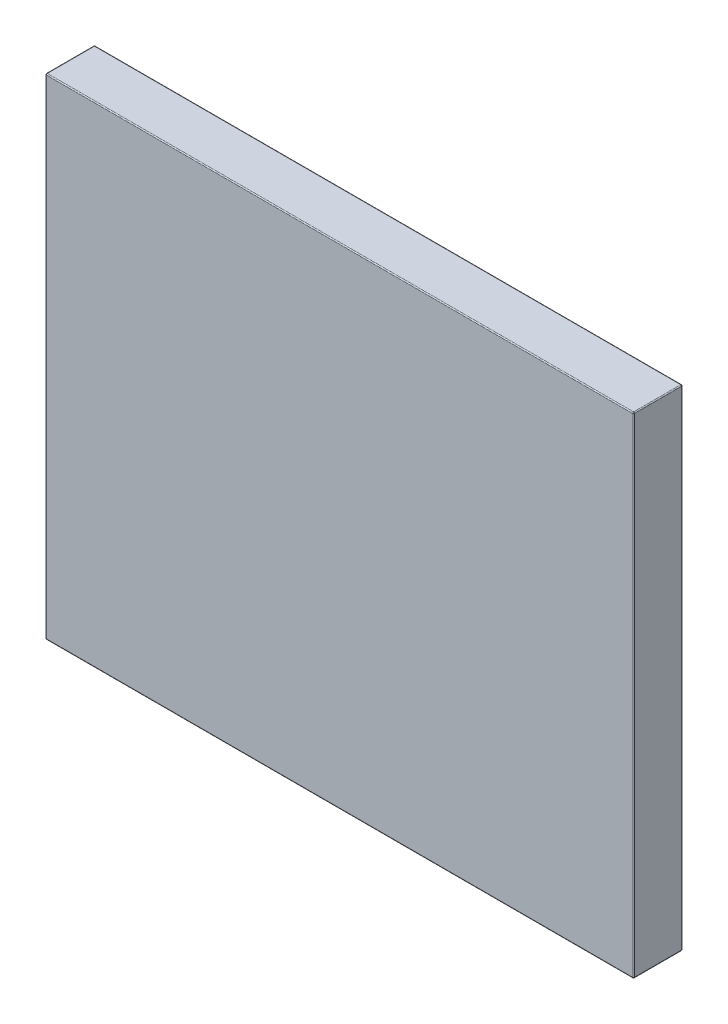
ISO-10303-21;
HEADER;
FILE_DESCRIPTION(('STEP AP214'),'2;1');
FILE_NAME('part.step','',(''),(''),'','','');
FILE_SCHEMA(('AUTOMOTIVE_DESIGN { 1 0 10303 214 1 1 1 1 }'));
ENDSEC;
DATA;
#1=APPLICATION_CONTEXT('core data for automotive mechanical design processes');
#2=APPLICATION_PROTOCOL_DEFINITION('international standard','automotive_design',2000,#1);
#3=PRODUCT_CONTEXT('',#1,'mechanical');
#4=PRODUCT('Part','Part','',(#3));
#5=PRODUCT_RELATED_PRODUCT_CATEGORY('part','',(#4));
#6=PRODUCT_DEFINITION_FORMATION('','',#4);
#7=PRODUCT_DEFINITION_CONTEXT('part definition',#1,'design');
#8=PRODUCT_DEFINITION('design','',#6,#7);
#9=PRODUCT_DEFINITION_SHAPE('','',#8);
#10=(LENGTH_UNIT() NAMED_UNIT(*) SI_UNIT(.MILLI.,.METRE.));
#11=(NAMED_UNIT(*) PLANE_ANGLE_UNIT() SI_UNIT($,.RADIAN.));
#12=(NAMED_UNIT(*) SI_UNIT($,.STERADIAN.) SOLID_ANGLE_UNIT());
#13=UNCERTAINTY_MEASURE_WITH_UNIT(LENGTH_MEASURE(1.E-05),#10,'distance_accuracy_value','');
#14=(GEOMETRIC_REPRESENTATION_CONTEXT(3) GLOBAL_UNCERTAINTY_ASSIGNED_CONTEXT((#13)) GLOBAL_UNIT_ASSIGNED_CONTEXT((#10,
#11,#12)) REPRESENTATION_CONTEXT('',''));
#15=CARTESIAN_POINT('',(0.,0.,0.));
#16=DIRECTION('',(0.,0.,1.));
#17=DIRECTION('',(1.,0.,0.));
#18=AXIS2_PLACEMENT_3D('',#15,#16,#17);
#19=CARTESIAN_POINT('',(0.299,-0.249,0.049));
#20=DIRECTION('',(-0.816496580927726,-0.408248290463863,0.408248290463863));
#21=DIRECTION('',(0.577350269189626,-0.577350269189626,0.577350269189626));
#22=AXIS2_PLACEMENT_3D('',#19,#20,#21);
#23=SPHERICAL_SURFACE('',#22,0.001);
#24=CARTESIAN_POINT('',(0.299,-0.249,0.049));
#25=DIRECTION('',(1.,0.,0.));
#26=DIRECTION('',(0.,-1.,0.));
#27=AXIS2_PLACEMENT_3D('',#24,#25,#26);
#28=CIRCLE('',#27,0.001);
#29=CARTESIAN_POINT('',(0.299,-0.249,0.05));
#30=VERTEX_POINT('',#29);
#31=CARTESIAN_POINT('',(0.299,-0.25,0.049));
#32=VERTEX_POINT('',#31);
#33=EDGE_CURVE('E11',#30,#32,#28,.T.);
#34=ORIENTED_EDGE('',*,*,#33,.T.);
#35=CARTESIAN_POINT('',(0.299,-0.249,0.049));
#36=DIRECTION('',(0.,0.,1.));
#37=DIRECTION('',(1.,0.,0.));
#38=AXIS2_PLACEMENT_3D('',#35,#36,#37);
#39=CIRCLE('',#38,0.001);
#40=CARTESIAN_POINT('',(0.3,-0.249,0.049));
#41=VERTEX_POINT('',#40);
#42=EDGE_CURVE('E28',#32,#41,#39,.T.);
#43=ORIENTED_EDGE('',*,*,#42,.T.);
#44=CARTESIAN_POINT('',(0.299,-0.249,0.049));
#45=DIRECTION('',(0.,-1.,0.));
#46=DIRECTION('',(0.,0.,1.));
#47=AXIS2_PLACEMENT_3D('',#44,#45,#46);
#48=CIRCLE('',#47,0.001);
#49=EDGE_CURVE('E204',#41,#30,#48,.T.);
#50=ORIENTED_EDGE('',*,*,#49,.T.);
#51=EDGE_LOOP('',(#34,#43,#50));
#52=FACE_BOUND('',#51,.T.);
#53=ADVANCED_FACE('F17',(#52),#23,.T.);
#54=CARTESIAN_POINT('',(-0.299,-0.249,0.049));
#55=DIRECTION('',(-0.816496580927726,0.408248290463863,-0.408248290463863));
#56=DIRECTION('',(-0.577350269189626,-0.577350269189626,0.577350269189626));
#57=AXIS2_PLACEMENT_3D('',#54,#55,#56);
#58=SPHERICAL_SURFACE('',#57,0.001);
#59=CARTESIAN_POINT('',(-0.299,-0.249,0.049));
#60=DIRECTION('',(0.,-1.,0.));
#61=DIRECTION('',(-1.,0.,0.));
#62=AXIS2_PLACEMENT_3D('',#59,#60,#61);
#63=CIRCLE('',#62,0.001);
#64=CARTESIAN_POINT('',(-0.299,-0.249,0.05));
#65=VERTEX_POINT('',#64);
#66=CARTESIAN_POINT('',(-0.3,-0.249,0.049));
#67=VERTEX_POINT('',#66);
#68=EDGE_CURVE('E201',#65,#67,#63,.T.);
#69=ORIENTED_EDGE('',*,*,#68,.T.);
#70=CARTESIAN_POINT('',(-0.299,-0.249,0.049));
#71=DIRECTION('',(0.,0.,1.));
#72=DIRECTION('',(0.,-1.,0.));
#73=AXIS2_PLACEMENT_3D('',#70,#71,#72);
#74=CIRCLE('',#73,0.001);
#75=CARTESIAN_POINT('',(-0.299,-0.25,0.049));
#76=VERTEX_POINT('',#75);
#77=EDGE_CURVE('E21',#67,#76,#74,.T.);
#78=ORIENTED_EDGE('',*,*,#77,.T.);
#79=CARTESIAN_POINT('',(-0.299,-0.249,0.049));
#80=DIRECTION('',(-1.,0.,0.));
#81=DIRECTION('',(0.,0.,1.));
#82=AXIS2_PLACEMENT_3D('',#79,#80,#81);
#83=CIRCLE('',#82,0.001);
#84=EDGE_CURVE('E176',#76,#65,#83,.T.);
#85=ORIENTED_EDGE('',*,*,#84,.T.);
#86=EDGE_LOOP('',(#69,#78,#85));
#87=FACE_BOUND('',#86,.T.);
#88=ADVANCED_FACE('F408',(#87),#58,.T.);
#89=CARTESIAN_POINT('',(0.299,-0.249,0.001));
#90=DIRECTION('',(-0.816496580927726,-0.408248290463863,-0.408248290463863));
#91=DIRECTION('',(0.577350269189626,-0.577350269189626,-0.577350269189626));
#92=AXIS2_PLACEMENT_3D('',#89,#90,#91);
#93=SPHERICAL_SURFACE('',#92,0.001);
#94=CARTESIAN_POINT('',(0.299,-0.249,0.001));
#95=DIRECTION('',(1.,0.,0.));
#96=DIRECTION('',(0.,0.,-1.));
#97=AXIS2_PLACEMENT_3D('',#94,#95,#96);
#98=CIRCLE('',#97,0.001);
#99=CARTESIAN_POINT('',(0.299,-0.25,0.001));
#100=VERTEX_POINT('',#99);
#101=CARTESIAN_POINT('',(0.299,-0.249,0.));
#102=VERTEX_POINT('',#101);
#103=EDGE_CURVE('E218',#100,#102,#98,.T.);
#104=ORIENTED_EDGE('',*,*,#103,.T.);
#105=CARTESIAN_POINT('',(0.299,-0.249,0.001));
#106=DIRECTION('',(0.,-1.,0.));
#107=DIRECTION('',(1.,0.,0.));
#108=AXIS2_PLACEMENT_3D('',#105,#106,#107);
#109=CIRCLE('',#108,0.001);
#110=CARTESIAN_POINT('',(0.3,-0.249,0.001));
#111=VERTEX_POINT('',#110);
#112=EDGE_CURVE('E223',#102,#111,#109,.T.);
#113=ORIENTED_EDGE('',*,*,#112,.T.);
#114=CARTESIAN_POINT('',(0.299,-0.249,0.001));
#115=DIRECTION('',(0.,0.,-1.));
#116=DIRECTION('',(0.,-1.,0.));
#117=AXIS2_PLACEMENT_3D('',#114,#115,#116);
#118=CIRCLE('',#117,0.001);
#119=EDGE_CURVE('E232',#111,#100,#118,.T.);
#120=ORIENTED_EDGE('',*,*,#119,.T.);
#121=EDGE_LOOP('',(#104,#113,#120));
#122=FACE_BOUND('',#121,.T.);
#123=ADVANCED_FACE('F332',(#122),#93,.T.);
#124=CARTESIAN_POINT('',(0.299,0.249,0.049));
#125=DIRECTION('',(0.408248290463863,0.408248290463863,-0.816496580927726));
#126=DIRECTION('',(0.577350269189626,0.577350269189626,0.577350269189626));
#127=AXIS2_PLACEMENT_3D('',#124,#125,#126);
#128=SPHERICAL_SURFACE('',#127,0.001);
#129=CARTESIAN_POINT('',(0.299,0.249,0.049));
#130=DIRECTION('',(0.,1.,0.));
#131=DIRECTION('',(1.,0.,0.));
#132=AXIS2_PLACEMENT_3D('',#129,#130,#131);
#133=CIRCLE('',#132,0.001);
#134=CARTESIAN_POINT('',(0.299,0.249,0.05));
#135=VERTEX_POINT('',#134);
#136=CARTESIAN_POINT('',(0.3,0.249,0.049));
#137=VERTEX_POINT('',#136);
#138=EDGE_CURVE('E242',#135,#137,#133,.T.);
#139=ORIENTED_EDGE('',*,*,#138,.T.);
#140=CARTESIAN_POINT('',(0.299,0.249,0.049));
#141=DIRECTION('',(0.,0.,1.));
#142=DIRECTION('',(0.,1.,0.));
#143=AXIS2_PLACEMENT_3D('',#140,#141,#142);
#144=CIRCLE('',#143,0.001);
#145=CARTESIAN_POINT('',(0.299,0.25,0.049));
#146=VERTEX_POINT('',#145);
#147=EDGE_CURVE('E132',#137,#146,#144,.T.);
#148=ORIENTED_EDGE('',*,*,#147,.T.);
#149=CARTESIAN_POINT('',(0.299,0.249,0.049));
#150=DIRECTION('',(1.,0.,0.));
#151=DIRECTION('',(0.,0.,1.));
#152=AXIS2_PLACEMENT_3D('',#149,#150,#151);
#153=CIRCLE('',#152,0.001);
#154=EDGE_CURVE('E301',#146,#135,#153,.T.);
#155=ORIENTED_EDGE('',*,*,#154,.T.);
#156=EDGE_LOOP('',(#139,#148,#155));
#157=FACE_BOUND('',#156,.T.);
#158=ADVANCED_FACE('F378',(#157),#128,.T.);
#159=CARTESIAN_POINT('',(-0.299,0.249,0.049));
#160=DIRECTION('',(-0.408248290463863,-0.816496580927726,0.408248290463863));
#161=DIRECTION('',(-0.577350269189626,0.577350269189626,0.577350269189626));
#162=AXIS2_PLACEMENT_3D('',#159,#160,#161);
#163=SPHERICAL_SURFACE('',#162,0.001);
#164=CARTESIAN_POINT('',(-0.299,0.249,0.049));
#165=DIRECTION('',(-1.,0.,0.));
#166=DIRECTION('',(0.,1.,0.));
#167=AXIS2_PLACEMENT_3D('',#164,#165,#166);
#168=CIRCLE('',#167,0.001);
#169=CARTESIAN_POINT('',(-0.299,0.249,0.05));
#170=VERTEX_POINT('',#169);
#171=CARTESIAN_POINT('',(-0.299,0.25,0.049));
#172=VERTEX_POINT('',#171);
#173=EDGE_CURVE('E239',#170,#172,#168,.T.);
#174=ORIENTED_EDGE('',*,*,#173,.T.);
#175=CARTESIAN_POINT('',(-0.299,0.249,0.049));
#176=DIRECTION('',(0.,0.,1.));
#177=DIRECTION('',(-1.,0.,0.));
#178=AXIS2_PLACEMENT_3D('',#175,#176,#177);
#179=CIRCLE('',#178,0.001);
#180=CARTESIAN_POINT('',(-0.3,0.249,0.049));
#181=VERTEX_POINT('',#180);
#182=EDGE_CURVE('E236',#172,#181,#179,.T.);
#183=ORIENTED_EDGE('',*,*,#182,.T.);
#184=CARTESIAN_POINT('',(-0.299,0.249,0.049));
#185=DIRECTION('',(0.,1.,0.));
#186=DIRECTION('',(0.,0.,1.));
#187=AXIS2_PLACEMENT_3D('',#184,#185,#186);
#188=CIRCLE('',#187,0.001);
#189=EDGE_CURVE('E191',#181,#170,#188,.T.);
#190=ORIENTED_EDGE('',*,*,#189,.T.);
#191=EDGE_LOOP('',(#174,#183,#190));
#192=FACE_BOUND('',#191,.T.);
#193=ADVANCED_FACE('F394',(#192),#163,.T.);
#194=CARTESIAN_POINT('',(-0.299,-0.249,0.001));
#195=DIRECTION('',(0.408248290463863,0.408248290463863,-0.816496580927726));
#196=DIRECTION('',(-0.577350269189626,-0.577350269189626,-0.577350269189626));
#197=AXIS2_PLACEMENT_3D('',#194,#195,#196);
#198=SPHERICAL_SURFACE('',#197,0.001);
#199=CARTESIAN_POINT('',(-0.299,-0.249,0.001));
#200=DIRECTION('',(0.,-1.,0.));
#201=DIRECTION('',(0.,0.,-1.));
#202=AXIS2_PLACEMENT_3D('',#199,#200,#201);
#203=CIRCLE('',#202,0.001);
#204=CARTESIAN_POINT('',(-0.3,-0.249,0.001));
#205=VERTEX_POINT('',#204);
#206=CARTESIAN_POINT('',(-0.299,-0.249,0.));
#207=VERTEX_POINT('',#206);
#208=EDGE_CURVE('E187',#205,#207,#203,.T.);
#209=ORIENTED_EDGE('',*,*,#208,.T.);
#210=CARTESIAN_POINT('',(-0.299,-0.249,0.001));
#211=DIRECTION('',(-1.,0.,0.));
#212=DIRECTION('',(0.,-1.,0.));
#213=AXIS2_PLACEMENT_3D('',#210,#211,#212);
#214=CIRCLE('',#213,0.001);
#215=CARTESIAN_POINT('',(-0.299,-0.25,0.001));
#216=VERTEX_POINT('',#215);
#217=EDGE_CURVE('E192',#207,#216,#214,.T.);
#218=ORIENTED_EDGE('',*,*,#217,.T.);
#219=CARTESIAN_POINT('',(-0.299,-0.249,0.001));
#220=DIRECTION('',(0.,0.,-1.));
#221=DIRECTION('',(-1.,0.,0.));
#222=AXIS2_PLACEMENT_3D('',#219,#220,#221);
#223=CIRCLE('',#222,0.001);
#224=EDGE_CURVE('E263',#216,#205,#223,.T.);
#225=ORIENTED_EDGE('',*,*,#224,.T.);
#226=EDGE_LOOP('',(#209,#218,#225));
#227=FACE_BOUND('',#226,.T.);
#228=ADVANCED_FACE('F396',(#227),#198,.T.);
#229=CARTESIAN_POINT('',(-0.15,-0.249,0.001));
#230=DIRECTION('',(-1.,0.,0.));
#231=DIRECTION('',(0.,-0.707106781186548,-0.707106781186548));
#232=AXIS2_PLACEMENT_3D('',#229,#230,#231);
#233=CYLINDRICAL_SURFACE('',#232,0.001);
#234=ORIENTED_EDGE('',*,*,#217,.F.);
#235=DIRECTION('',(1.,0.,0.));
#236=VECTOR('',#235,1.);
#237=CARTESIAN_POINT('',(-0.15,-0.249,0.));
#238=LINE('',#237,#236);
#239=EDGE_CURVE('E200',#207,#102,#238,.T.);
#240=ORIENTED_EDGE('',*,*,#239,.T.);
#241=ORIENTED_EDGE('',*,*,#103,.F.);
#242=DIRECTION('',(-1.,0.,0.));
#243=VECTOR('',#242,1.);
#244=CARTESIAN_POINT('',(-0.15,-0.25,0.001));
#245=LINE('',#244,#243);
#246=EDGE_CURVE('E75',#100,#216,#245,.T.);
#247=ORIENTED_EDGE('',*,*,#246,.T.);
#248=EDGE_LOOP('',(#234,#240,#241,#247));
#249=FACE_BOUND('',#248,.T.);
#250=ADVANCED_FACE('F19',(#249),#233,.T.);
#251=CARTESIAN_POINT('',(-0.299,-0.249,0.));
#252=DIRECTION('',(0.,0.,1.));
#253=DIRECTION('',(-0.707106781186548,-0.707106781186548,0.));
#254=AXIS2_PLACEMENT_3D('',#251,#252,#253);
#255=CYLINDRICAL_SURFACE('',#254,0.001);
#256=ORIENTED_EDGE('',*,*,#77,.F.);
#257=DIRECTION('',(0.,0.,-1.));
#258=VECTOR('',#257,1.);
#259=CARTESIAN_POINT('',(-0.3,-0.249,0.));
#260=LINE('',#259,#258);
#261=EDGE_CURVE('E181',#67,#205,#260,.T.);
#262=ORIENTED_EDGE('',*,*,#261,.T.);
#263=ORIENTED_EDGE('',*,*,#224,.F.);
#264=DIRECTION('',(0.,0.,1.));
#265=VECTOR('',#264,1.);
#266=CARTESIAN_POINT('',(-0.299,-0.25,0.));
#267=LINE('',#266,#265);
#268=EDGE_CURVE('E158',#216,#76,#267,.T.);
#269=ORIENTED_EDGE('',*,*,#268,.T.);
#270=EDGE_LOOP('',(#256,#262,#263,#269));
#271=FACE_BOUND('',#270,.T.);
#272=ADVANCED_FACE('F432',(#271),#255,.T.);
#273=CARTESIAN_POINT('',(0.299,0.249,0.001));
#274=DIRECTION('',(-0.408248290463863,-0.408248290463863,-0.816496580927726));
#275=DIRECTION('',(0.577350269189626,0.577350269189626,-0.577350269189626));
#276=AXIS2_PLACEMENT_3D('',#273,#274,#275);
#277=SPHERICAL_SURFACE('',#276,0.001);
#278=CARTESIAN_POINT('',(0.299,0.249,0.001));
#279=DIRECTION('',(0.,1.,0.));
#280=DIRECTION('',(0.,0.,-1.));
#281=AXIS2_PLACEMENT_3D('',#278,#279,#280);
#282=CIRCLE('',#281,0.001);
#283=CARTESIAN_POINT('',(0.3,0.249,0.001));
#284=VERTEX_POINT('',#283);
#285=CARTESIAN_POINT('',(0.299,0.249,0.));
#286=VERTEX_POINT('',#285);
#287=EDGE_CURVE('E142',#284,#286,#282,.T.);
#288=ORIENTED_EDGE('',*,*,#287,.T.);
#289=CARTESIAN_POINT('',(0.299,0.249,0.001));
#290=DIRECTION('',(1.,0.,0.));
#291=DIRECTION('',(0.,1.,0.));
#292=AXIS2_PLACEMENT_3D('',#289,#290,#291);
#293=CIRCLE('',#292,0.001);
#294=CARTESIAN_POINT('',(0.299,0.25,0.001));
#295=VERTEX_POINT('',#294);
#296=EDGE_CURVE('E145',#286,#295,#293,.T.);
#297=ORIENTED_EDGE('',*,*,#296,.T.);
#298=CARTESIAN_POINT('',(0.299,0.249,0.001));
#299=DIRECTION('',(0.,0.,-1.));
#300=DIRECTION('',(1.,0.,0.));
#301=AXIS2_PLACEMENT_3D('',#298,#299,#300);
#302=CIRCLE('',#301,0.001);
#303=EDGE_CURVE('E129',#295,#284,#302,.T.);
#304=ORIENTED_EDGE('',*,*,#303,.T.);
#305=EDGE_LOOP('',(#288,#297,#304));
#306=FACE_BOUND('',#305,.T.);
#307=ADVANCED_FACE('F141',(#306),#277,.T.);
#308=CARTESIAN_POINT('',(-0.299,0.249,0.001));
#309=DIRECTION('',(-0.408248290463863,-0.816496580927726,-0.408248290463863));
#310=DIRECTION('',(-0.577350269189626,0.577350269189626,-0.577350269189626));
#311=AXIS2_PLACEMENT_3D('',#308,#309,#310);
#312=SPHERICAL_SURFACE('',#311,0.001);
#313=CARTESIAN_POINT('',(-0.299,0.249,0.001));
#314=DIRECTION('',(0.,0.,-1.));
#315=DIRECTION('',(0.,1.,0.));
#316=AXIS2_PLACEMENT_3D('',#313,#314,#315);
#317=CIRCLE('',#316,0.001);
#318=CARTESIAN_POINT('',(-0.3,0.249,0.001));
#319=VERTEX_POINT('',#318);
#320=CARTESIAN_POINT('',(-0.299,0.25,0.001));
#321=VERTEX_POINT('',#320);
#322=EDGE_CURVE('E148',#319,#321,#317,.T.);
#323=ORIENTED_EDGE('',*,*,#322,.T.);
#324=CARTESIAN_POINT('',(-0.299,0.249,0.001));
#325=DIRECTION('',(-1.,0.,0.));
#326=DIRECTION('',(0.,0.,-1.));
#327=AXIS2_PLACEMENT_3D('',#324,#325,#326);
#328=CIRCLE('',#327,0.001);
#329=CARTESIAN_POINT('',(-0.299,0.249,0.));
#330=VERTEX_POINT('',#329);
#331=EDGE_CURVE('E246',#321,#330,#328,.T.);
#332=ORIENTED_EDGE('',*,*,#331,.T.);
#333=CARTESIAN_POINT('',(-0.299,0.249,0.001));
#334=DIRECTION('',(0.,1.,0.));
#335=DIRECTION('',(-1.,0.,0.));
#336=AXIS2_PLACEMENT_3D('',#333,#334,#335);
#337=CIRCLE('',#336,0.001);
#338=EDGE_CURVE('E254',#330,#319,#337,.T.);
#339=ORIENTED_EDGE('',*,*,#338,.T.);
#340=EDGE_LOOP('',(#323,#332,#339));
#341=FACE_BOUND('',#340,.T.);
#342=ADVANCED_FACE('F364',(#341),#312,.T.);
#343=CARTESIAN_POINT('',(0.15,0.249,0.001));
#344=DIRECTION('',(1.,0.,0.));
#345=DIRECTION('',(0.,0.707106781186548,-0.707106781186548));
#346=AXIS2_PLACEMENT_3D('',#343,#344,#345);
#347=CYLINDRICAL_SURFACE('',#346,0.001);
#348=ORIENTED_EDGE('',*,*,#296,.F.);
#349=DIRECTION('',(-1.,0.,0.));
#350=VECTOR('',#349,1.);
#351=CARTESIAN_POINT('',(0.15,0.249,0.));
#352=LINE('',#351,#350);
#353=EDGE_CURVE('E292',#286,#330,#352,.T.);
#354=ORIENTED_EDGE('',*,*,#353,.T.);
#355=ORIENTED_EDGE('',*,*,#331,.F.);
#356=DIRECTION('',(1.,0.,0.));
#357=VECTOR('',#356,1.);
#358=CARTESIAN_POINT('',(0.15,0.25,0.001));
#359=LINE('',#358,#357);
#360=EDGE_CURVE('E197',#321,#295,#359,.T.);
#361=ORIENTED_EDGE('',*,*,#360,.T.);
#362=EDGE_LOOP('',(#348,#354,#355,#361));
#363=FACE_BOUND('',#362,.T.);
#364=ADVANCED_FACE('F448',(#363),#347,.T.);
#365=CARTESIAN_POINT('',(-0.299,0.125,0.001));
#366=DIRECTION('',(0.,1.,0.));
#367=DIRECTION('',(-0.707106781186548,0.,-0.707106781186548));
#368=AXIS2_PLACEMENT_3D('',#365,#366,#367);
#369=CYLINDRICAL_SURFACE('',#368,0.001);
#370=ORIENTED_EDGE('',*,*,#338,.F.);
#371=DIRECTION('',(0.,-1.,0.));
#372=VECTOR('',#371,1.);
#373=CARTESIAN_POINT('',(-0.299,0.125,0.));
#374=LINE('',#373,#372);
#375=EDGE_CURVE('E193',#330,#207,#374,.T.);
#376=ORIENTED_EDGE('',*,*,#375,.T.);
#377=ORIENTED_EDGE('',*,*,#208,.F.);
#378=DIRECTION('',(0.,1.,0.));
#379=VECTOR('',#378,1.);
#380=CARTESIAN_POINT('',(-0.3,0.125,0.001));
#381=LINE('',#380,#379);
#382=EDGE_CURVE('E198',#205,#319,#381,.T.);
#383=ORIENTED_EDGE('',*,*,#382,.T.);
#384=EDGE_LOOP('',(#370,#376,#377,#383));
#385=FACE_BOUND('',#384,.T.);
#386=ADVANCED_FACE('F359',(#385),#369,.T.);
#387=CARTESIAN_POINT('',(-0.299,0.249,0.));
#388=DIRECTION('',(0.,0.,1.));
#389=DIRECTION('',(-0.707106781186548,0.707106781186548,0.));
#390=AXIS2_PLACEMENT_3D('',#387,#388,#389);
#391=CYLINDRICAL_SURFACE('',#390,0.001);
#392=ORIENTED_EDGE('',*,*,#182,.F.);
#393=DIRECTION('',(0.,0.,-1.));
#394=VECTOR('',#393,1.);
#395=CARTESIAN_POINT('',(-0.299,0.25,0.));
#396=LINE('',#395,#394);
#397=EDGE_CURVE('E250',#172,#321,#396,.T.);
#398=ORIENTED_EDGE('',*,*,#397,.T.);
#399=ORIENTED_EDGE('',*,*,#322,.F.);
#400=DIRECTION('',(0.,0.,1.));
#401=VECTOR('',#400,1.);
#402=CARTESIAN_POINT('',(-0.3,0.249,0.));
#403=LINE('',#402,#401);
#404=EDGE_CURVE('E135',#319,#181,#403,.T.);
#405=ORIENTED_EDGE('',*,*,#404,.T.);
#406=EDGE_LOOP('',(#392,#398,#399,#405));
#407=FACE_BOUND('',#406,.T.);
#408=ADVANCED_FACE('F367',(#407),#391,.T.);
#409=CARTESIAN_POINT('',(0.299,0.249,0.));
#410=DIRECTION('',(0.,0.,1.));
#411=DIRECTION('',(0.707106781186548,0.707106781186548,0.));
#412=AXIS2_PLACEMENT_3D('',#409,#410,#411);
#413=CYLINDRICAL_SURFACE('',#412,0.001);
#414=ORIENTED_EDGE('',*,*,#147,.F.);
#415=DIRECTION('',(0.,0.,-1.));
#416=VECTOR('',#415,1.);
#417=CARTESIAN_POINT('',(0.3,0.249,0.));
#418=LINE('',#417,#416);
#419=EDGE_CURVE('E86',#137,#284,#418,.T.);
#420=ORIENTED_EDGE('',*,*,#419,.T.);
#421=ORIENTED_EDGE('',*,*,#303,.F.);
#422=DIRECTION('',(0.,0.,1.));
#423=VECTOR('',#422,1.);
#424=CARTESIAN_POINT('',(0.299,0.25,0.));
#425=LINE('',#424,#423);
#426=EDGE_CURVE('E136',#295,#146,#425,.T.);
#427=ORIENTED_EDGE('',*,*,#426,.T.);
#428=EDGE_LOOP('',(#414,#420,#421,#427));
#429=FACE_BOUND('',#428,.T.);
#430=ADVANCED_FACE('F128',(#429),#413,.T.);
#431=CARTESIAN_POINT('',(0.299,-0.125,0.001));
#432=DIRECTION('',(0.,-1.,0.));
#433=DIRECTION('',(0.707106781186548,0.,-0.707106781186548));
#434=AXIS2_PLACEMENT_3D('',#431,#432,#433);
#435=CYLINDRICAL_SURFACE('',#434,0.001);
#436=ORIENTED_EDGE('',*,*,#112,.F.);
#437=DIRECTION('',(0.,1.,0.));
#438=VECTOR('',#437,1.);
#439=CARTESIAN_POINT('',(0.299,-0.125,0.));
#440=LINE('',#439,#438);
#441=EDGE_CURVE('E156',#102,#286,#440,.T.);
#442=ORIENTED_EDGE('',*,*,#441,.T.);
#443=ORIENTED_EDGE('',*,*,#287,.F.);
#444=DIRECTION('',(0.,-1.,0.));
#445=VECTOR('',#444,1.);
#446=CARTESIAN_POINT('',(0.3,-0.125,0.001));
#447=LINE('',#446,#445);
#448=EDGE_CURVE('E153',#284,#111,#447,.T.);
#449=ORIENTED_EDGE('',*,*,#448,.T.);
#450=EDGE_LOOP('',(#436,#442,#443,#449));
#451=FACE_BOUND('',#450,.T.);
#452=ADVANCED_FACE('F152',(#451),#435,.T.);
#453=CARTESIAN_POINT('',(-0.299,0.125,0.049));
#454=DIRECTION('',(0.,-1.,0.));
#455=DIRECTION('',(-0.707106781186548,0.,0.707106781186548));
#456=AXIS2_PLACEMENT_3D('',#453,#454,#455);
#457=CYLINDRICAL_SURFACE('',#456,0.001);
#458=ORIENTED_EDGE('',*,*,#68,.F.);
#459=DIRECTION('',(0.,1.,0.));
#460=VECTOR('',#459,1.);
#461=CARTESIAN_POINT('',(-0.299,0.125,0.05));
#462=LINE('',#461,#460);
#463=EDGE_CURVE('E165',#65,#170,#462,.T.);
#464=ORIENTED_EDGE('',*,*,#463,.T.);
#465=ORIENTED_EDGE('',*,*,#189,.F.);
#466=DIRECTION('',(0.,-1.,0.));
#467=VECTOR('',#466,1.);
#468=CARTESIAN_POINT('',(-0.3,0.125,0.049));
#469=LINE('',#468,#467);
#470=EDGE_CURVE('E173',#181,#67,#469,.T.);
#471=ORIENTED_EDGE('',*,*,#470,.T.);
#472=EDGE_LOOP('',(#458,#464,#465,#471));
#473=FACE_BOUND('',#472,.T.);
#474=ADVANCED_FACE('F392',(#473),#457,.T.);
#475=CARTESIAN_POINT('',(0.15,0.249,0.049));
#476=DIRECTION('',(-1.,0.,0.));
#477=DIRECTION('',(0.,0.707106781186548,0.707106781186548));
#478=AXIS2_PLACEMENT_3D('',#475,#476,#477);
#479=CYLINDRICAL_SURFACE('',#478,0.001);
#480=ORIENTED_EDGE('',*,*,#173,.F.);
#481=DIRECTION('',(1.,0.,0.));
#482=VECTOR('',#481,1.);
#483=CARTESIAN_POINT('',(0.15,0.249,0.05));
#484=LINE('',#483,#482);
#485=EDGE_CURVE('E289',#170,#135,#484,.T.);
#486=ORIENTED_EDGE('',*,*,#485,.T.);
#487=ORIENTED_EDGE('',*,*,#154,.F.);
#488=DIRECTION('',(-1.,0.,0.));
#489=VECTOR('',#488,1.);
#490=CARTESIAN_POINT('',(0.15,0.25,0.049));
#491=LINE('',#490,#489);
#492=EDGE_CURVE('E285',#146,#172,#491,.T.);
#493=ORIENTED_EDGE('',*,*,#492,.T.);
#494=EDGE_LOOP('',(#480,#486,#487,#493));
#495=FACE_BOUND('',#494,.T.);
#496=ADVANCED_FACE('F385',(#495),#479,.T.);
#497=CARTESIAN_POINT('',(0.299,-0.125,0.049));
#498=DIRECTION('',(0.,1.,0.));
#499=DIRECTION('',(0.707106781186548,0.,0.707106781186548));
#500=AXIS2_PLACEMENT_3D('',#497,#498,#499);
#501=CYLINDRICAL_SURFACE('',#500,0.001);
#502=ORIENTED_EDGE('',*,*,#138,.F.);
#503=DIRECTION('',(0.,-1.,0.));
#504=VECTOR('',#503,1.);
#505=CARTESIAN_POINT('',(0.299,-0.125,0.05));
#506=LINE('',#505,#504);
#507=EDGE_CURVE('E186',#135,#30,#506,.T.);
#508=ORIENTED_EDGE('',*,*,#507,.T.);
#509=ORIENTED_EDGE('',*,*,#49,.F.);
#510=DIRECTION('',(0.,1.,0.));
#511=VECTOR('',#510,1.);
#512=CARTESIAN_POINT('',(0.3,-0.125,0.049));
#513=LINE('',#512,#511);
#514=EDGE_CURVE('E182',#41,#137,#513,.T.);
#515=ORIENTED_EDGE('',*,*,#514,.T.);
#516=EDGE_LOOP('',(#502,#508,#509,#515));
#517=FACE_BOUND('',#516,.T.);
#518=ADVANCED_FACE('F417',(#517),#501,.T.);
#519=CARTESIAN_POINT('',(0.299,-0.249,0.));
#520=DIRECTION('',(0.,0.,1.));
#521=DIRECTION('',(0.707106781186548,-0.707106781186548,0.));
#522=AXIS2_PLACEMENT_3D('',#519,#520,#521);
#523=CYLINDRICAL_SURFACE('',#522,0.001);
#524=ORIENTED_EDGE('',*,*,#42,.F.);
#525=DIRECTION('',(0.,0.,-1.));
#526=VECTOR('',#525,1.);
#527=CARTESIAN_POINT('',(0.299,-0.25,0.));
#528=LINE('',#527,#526);
#529=EDGE_CURVE('E42',#32,#100,#528,.T.);
#530=ORIENTED_EDGE('',*,*,#529,.T.);
#531=ORIENTED_EDGE('',*,*,#119,.F.);
#532=DIRECTION('',(0.,0.,1.));
#533=VECTOR('',#532,1.);
#534=CARTESIAN_POINT('',(0.3,-0.249,0.));
#535=LINE('',#534,#533);
#536=EDGE_CURVE('E163',#111,#41,#535,.T.);
#537=ORIENTED_EDGE('',*,*,#536,.T.);
#538=EDGE_LOOP('',(#524,#530,#531,#537));
#539=FACE_BOUND('',#538,.T.);
#540=ADVANCED_FACE('F333',(#539),#523,.T.);
#541=CARTESIAN_POINT('',(-0.15,-0.249,0.049));
#542=DIRECTION('',(1.,0.,0.));
#543=DIRECTION('',(0.,-0.707106781186548,0.707106781186548));
#544=AXIS2_PLACEMENT_3D('',#541,#542,#543);
#545=CYLINDRICAL_SURFACE('',#544,0.001);
#546=ORIENTED_EDGE('',*,*,#33,.F.);
#547=DIRECTION('',(-1.,0.,0.));
#548=VECTOR('',#547,1.);
#549=CARTESIAN_POINT('',(-0.15,-0.249,0.05));
#550=LINE('',#549,#548);
#551=EDGE_CURVE('E259',#30,#65,#550,.T.);
#552=ORIENTED_EDGE('',*,*,#551,.T.);
#553=ORIENTED_EDGE('',*,*,#84,.F.);
#554=DIRECTION('',(1.,0.,0.));
#555=VECTOR('',#554,1.);
#556=CARTESIAN_POINT('',(-0.15,-0.25,0.049));
#557=LINE('',#556,#555);
#558=EDGE_CURVE('E255',#76,#32,#557,.T.);
#559=ORIENTED_EDGE('',*,*,#558,.T.);
#560=EDGE_LOOP('',(#546,#552,#553,#559));
#561=FACE_BOUND('',#560,.T.);
#562=ADVANCED_FACE('F336',(#561),#545,.T.);
#563=CARTESIAN_POINT('',(-0.3,-0.25,0.));
#564=DIRECTION('',(0.,-1.,0.));
#565=DIRECTION('',(0.,0.,-1.));
#566=AXIS2_PLACEMENT_3D('',#563,#564,#565);
#567=PLANE('',#566);
#568=ORIENTED_EDGE('',*,*,#246,.F.);
#569=ORIENTED_EDGE('',*,*,#529,.F.);
#570=ORIENTED_EDGE('',*,*,#558,.F.);
#571=ORIENTED_EDGE('',*,*,#268,.F.);
#572=EDGE_LOOP('',(#568,#569,#570,#571));
#573=FACE_BOUND('',#572,.T.);
#574=ADVANCED_FACE('F337',(#573),#567,.T.);
#575=CARTESIAN_POINT('',(-0.3,0.25,0.));
#576=DIRECTION('',(-1.,0.,0.));
#577=DIRECTION('',(0.,0.,1.));
#578=AXIS2_PLACEMENT_3D('',#575,#576,#577);
#579=PLANE('',#578);
#580=ORIENTED_EDGE('',*,*,#261,.F.);
#581=ORIENTED_EDGE('',*,*,#470,.F.);
#582=ORIENTED_EDGE('',*,*,#404,.F.);
#583=ORIENTED_EDGE('',*,*,#382,.F.);
#584=EDGE_LOOP('',(#580,#581,#582,#583));
#585=FACE_BOUND('',#584,.T.);
#586=ADVANCED_FACE('F370',(#585),#579,.T.);
#587=CARTESIAN_POINT('',(0.3,0.25,0.));
#588=DIRECTION('',(0.,1.,0.));
#589=DIRECTION('',(1.,0.,0.));
#590=AXIS2_PLACEMENT_3D('',#587,#588,#589);
#591=PLANE('',#590);
#592=ORIENTED_EDGE('',*,*,#360,.F.);
#593=ORIENTED_EDGE('',*,*,#397,.F.);
#594=ORIENTED_EDGE('',*,*,#492,.F.);
#595=ORIENTED_EDGE('',*,*,#426,.F.);
#596=EDGE_LOOP('',(#592,#593,#594,#595));
#597=FACE_BOUND('',#596,.T.);
#598=ADVANCED_FACE('F382',(#597),#591,.T.);
#599=CARTESIAN_POINT('',(0.,0.,0.));
#600=DIRECTION('',(0.,0.,1.));
#601=DIRECTION('',(1.,0.,0.));
#602=AXIS2_PLACEMENT_3D('',#599,#600,#601);
#603=PLANE('',#602);
#604=ORIENTED_EDGE('',*,*,#353,.F.);
#605=ORIENTED_EDGE('',*,*,#441,.F.);
#606=ORIENTED_EDGE('',*,*,#239,.F.);
#607=ORIENTED_EDGE('',*,*,#375,.F.);
#608=EDGE_LOOP('',(#604,#605,#606,#607));
#609=FACE_BOUND('',#608,.T.);
#610=ADVANCED_FACE('F425',(#609),#603,.F.);
#611=CARTESIAN_POINT('',(0.3,-0.25,0.));
#612=DIRECTION('',(1.,0.,0.));
#613=DIRECTION('',(0.,1.,0.));
#614=AXIS2_PLACEMENT_3D('',#611,#612,#613);
#615=PLANE('',#614);
#616=ORIENTED_EDGE('',*,*,#419,.F.);
#617=ORIENTED_EDGE('',*,*,#514,.F.);
#618=ORIENTED_EDGE('',*,*,#536,.F.);
#619=ORIENTED_EDGE('',*,*,#448,.F.);
#620=EDGE_LOOP('',(#616,#617,#618,#619));
#621=FACE_BOUND('',#620,.T.);
#622=ADVANCED_FACE('F161',(#621),#615,.T.);
#623=CARTESIAN_POINT('',(0.,0.,0.05));
#624=DIRECTION('',(0.,0.,1.));
#625=DIRECTION('',(1.,0.,0.));
#626=AXIS2_PLACEMENT_3D('',#623,#624,#625);
#627=PLANE('',#626);
#628=ORIENTED_EDGE('',*,*,#463,.F.);
#629=ORIENTED_EDGE('',*,*,#551,.F.);
#630=ORIENTED_EDGE('',*,*,#507,.F.);
#631=ORIENTED_EDGE('',*,*,#485,.F.);
#632=EDGE_LOOP('',(#628,#629,#630,#631));
#633=FACE_BOUND('',#632,.T.);
#634=ADVANCED_FACE('F389',(#633),#627,.T.);
#635=CLOSED_SHELL('',(#53,#88,#123,#158,#193,#228,#250,#272,#307,#342,#364,#386,#408,#430,#452,
#474,#496,#518,#540,#562,#574,#586,#598,#610,#622,#634));
#636=MANIFOLD_SOLID_BREP('B1',#635);
#637=ADVANCED_BREP_SHAPE_REPRESENTATION('',(#18,#636),#14);
#638=SHAPE_DEFINITION_REPRESENTATION(#9,#637);
ENDSEC;
END-ISO-10303-21;
